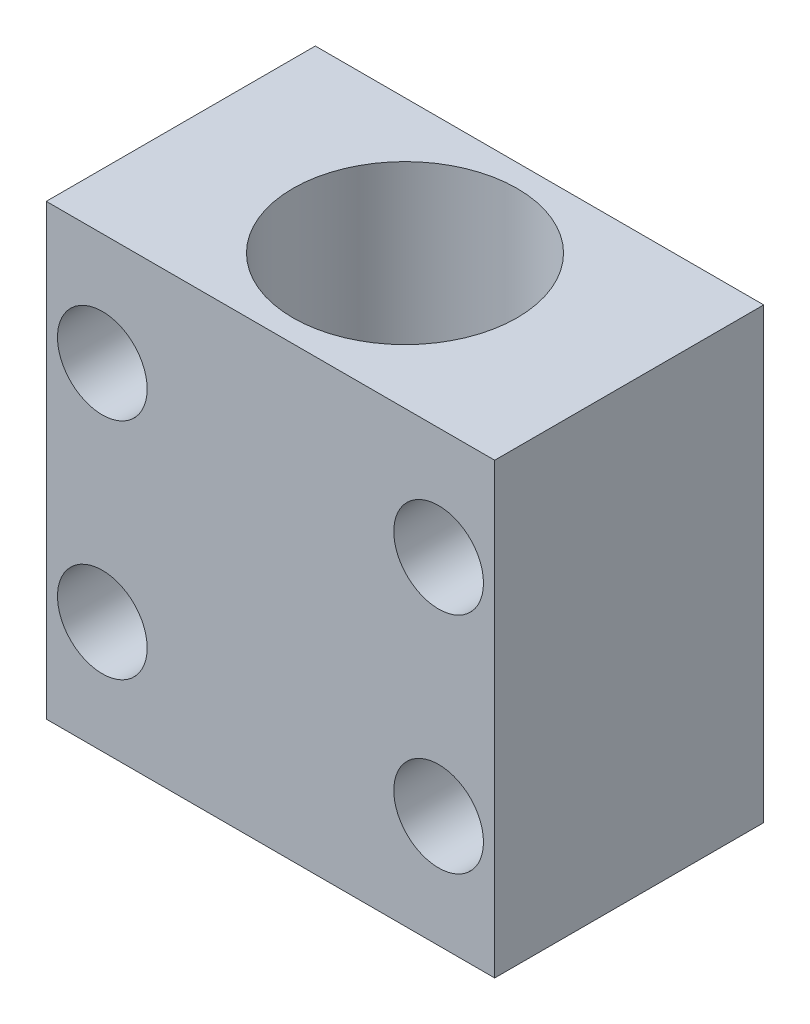
ISO-10303-21;
HEADER;
FILE_DESCRIPTION(('STEP AP214'),'2;1');
FILE_NAME('part.step','',(''),(''),'','','');
FILE_SCHEMA(('AUTOMOTIVE_DESIGN { 1 0 10303 214 1 1 1 1 }'));
ENDSEC;
DATA;
#1=APPLICATION_CONTEXT('core data for automotive mechanical design processes');
#2=APPLICATION_PROTOCOL_DEFINITION('international standard','automotive_design',2000,#1);
#3=PRODUCT_CONTEXT('',#1,'mechanical');
#4=PRODUCT('Part','Part','',(#3));
#5=PRODUCT_RELATED_PRODUCT_CATEGORY('part','',(#4));
#6=PRODUCT_DEFINITION_FORMATION('','',#4);
#7=PRODUCT_DEFINITION_CONTEXT('part definition',#1,'design');
#8=PRODUCT_DEFINITION('design','',#6,#7);
#9=PRODUCT_DEFINITION_SHAPE('','',#8);
#10=(LENGTH_UNIT() NAMED_UNIT(*) SI_UNIT(.MILLI.,.METRE.));
#11=(NAMED_UNIT(*) PLANE_ANGLE_UNIT() SI_UNIT($,.RADIAN.));
#12=(NAMED_UNIT(*) SI_UNIT($,.STERADIAN.) SOLID_ANGLE_UNIT());
#13=UNCERTAINTY_MEASURE_WITH_UNIT(LENGTH_MEASURE(1.E-05),#10,'distance_accuracy_value','');
#14=(GEOMETRIC_REPRESENTATION_CONTEXT(3) GLOBAL_UNCERTAINTY_ASSIGNED_CONTEXT((#13)) GLOBAL_UNIT_ASSIGNED_CONTEXT((#10,
#11,#12)) REPRESENTATION_CONTEXT('',''));
#15=CARTESIAN_POINT('',(0.,0.,0.));
#16=DIRECTION('',(0.,0.,1.));
#17=DIRECTION('',(1.,0.,0.));
#18=AXIS2_PLACEMENT_3D('',#15,#16,#17);
#19=CARTESIAN_POINT('',(0.,127.,0.));
#20=DIRECTION('',(0.,1.,0.));
#21=DIRECTION('',(0.,0.,1.));
#22=AXIS2_PLACEMENT_3D('',#19,#20,#21);
#23=PLANE('',#22);
#24=DIRECTION('',(0.,0.,-1.));
#25=VECTOR('',#24,1.);
#26=CARTESIAN_POINT('',(63.5,127.,-38.1));
#27=LINE('',#26,#25);
#28=CARTESIAN_POINT('',(63.5,127.,38.1));
#29=VERTEX_POINT('',#28);
#30=CARTESIAN_POINT('',(63.5,127.,-38.1));
#31=VERTEX_POINT('',#30);
#32=EDGE_CURVE('E88',#29,#31,#27,.T.);
#33=ORIENTED_EDGE('',*,*,#32,.T.);
#34=DIRECTION('',(-1.,0.,0.));
#35=VECTOR('',#34,1.);
#36=CARTESIAN_POINT('',(-63.5,127.,-38.1));
#37=LINE('',#36,#35);
#38=CARTESIAN_POINT('',(-63.5,127.,-38.1));
#39=VERTEX_POINT('',#38);
#40=EDGE_CURVE('E83',#31,#39,#37,.T.);
#41=ORIENTED_EDGE('',*,*,#40,.T.);
#42=DIRECTION('',(0.,0.,1.));
#43=VECTOR('',#42,1.);
#44=CARTESIAN_POINT('',(-63.5,127.,-38.1));
#45=LINE('',#44,#43);
#46=CARTESIAN_POINT('',(-63.5,127.,38.1));
#47=VERTEX_POINT('',#46);
#48=EDGE_CURVE('E86',#39,#47,#45,.T.);
#49=ORIENTED_EDGE('',*,*,#48,.T.);
#50=DIRECTION('',(1.,0.,0.));
#51=VECTOR('',#50,1.);
#52=CARTESIAN_POINT('',(-63.5,127.,38.1));
#53=LINE('',#52,#51);
#54=EDGE_CURVE('E53',#47,#29,#53,.T.);
#55=ORIENTED_EDGE('',*,*,#54,.T.);
#56=EDGE_LOOP('',(#33,#41,#49,#55));
#57=FACE_BOUND('',#56,.T.);
#58=CARTESIAN_POINT('',(0.,127.,0.));
#59=DIRECTION('',(0.,1.,0.));
#60=DIRECTION('',(0.,0.,1.));
#61=AXIS2_PLACEMENT_3D('',#58,#59,#60);
#62=CIRCLE('',#61,31.75);
#63=CARTESIAN_POINT('',(0.,127.,31.75));
#64=VERTEX_POINT('',#63);
#65=EDGE_CURVE('E103',#64,#64,#62,.T.);
#66=ORIENTED_EDGE('',*,*,#65,.F.);
#67=EDGE_LOOP('',(#66));
#68=FACE_BOUND('',#67,.T.);
#69=ADVANCED_FACE('F36',(#57,#68),#23,.T.);
#70=CARTESIAN_POINT('',(0.,0.,0.));
#71=DIRECTION('',(0.,1.,0.));
#72=DIRECTION('',(0.,0.,1.));
#73=AXIS2_PLACEMENT_3D('',#70,#71,#72);
#74=PLANE('',#73);
#75=DIRECTION('',(0.,0.,-1.));
#76=VECTOR('',#75,1.);
#77=CARTESIAN_POINT('',(63.5,0.,-38.1));
#78=LINE('',#77,#76);
#79=CARTESIAN_POINT('',(63.5,0.,38.1));
#80=VERTEX_POINT('',#79);
#81=CARTESIAN_POINT('',(63.5,0.,-38.1));
#82=VERTEX_POINT('',#81);
#83=EDGE_CURVE('E100',#80,#82,#78,.T.);
#84=ORIENTED_EDGE('',*,*,#83,.F.);
#85=DIRECTION('',(1.,0.,0.));
#86=VECTOR('',#85,1.);
#87=CARTESIAN_POINT('',(-63.5,0.,38.1));
#88=LINE('',#87,#86);
#89=CARTESIAN_POINT('',(-63.5,0.,38.1));
#90=VERTEX_POINT('',#89);
#91=EDGE_CURVE('E76',#90,#80,#88,.T.);
#92=ORIENTED_EDGE('',*,*,#91,.F.);
#93=DIRECTION('',(0.,0.,1.));
#94=VECTOR('',#93,1.);
#95=CARTESIAN_POINT('',(-63.5,0.,-38.1));
#96=LINE('',#95,#94);
#97=CARTESIAN_POINT('',(-63.5,0.,-38.1));
#98=VERTEX_POINT('',#97);
#99=EDGE_CURVE('E70',#98,#90,#96,.T.);
#100=ORIENTED_EDGE('',*,*,#99,.F.);
#101=DIRECTION('',(-1.,0.,0.));
#102=VECTOR('',#101,1.);
#103=CARTESIAN_POINT('',(-63.5,0.,-38.1));
#104=LINE('',#103,#102);
#105=EDGE_CURVE('E92',#82,#98,#104,.T.);
#106=ORIENTED_EDGE('',*,*,#105,.F.);
#107=EDGE_LOOP('',(#84,#92,#100,#106));
#108=FACE_BOUND('',#107,.T.);
#109=CARTESIAN_POINT('',(0.,0.,0.));
#110=DIRECTION('',(0.,1.,0.));
#111=DIRECTION('',(0.,0.,1.));
#112=AXIS2_PLACEMENT_3D('',#109,#110,#111);
#113=CIRCLE('',#112,31.75);
#114=CARTESIAN_POINT('',(0.,0.,31.75));
#115=VERTEX_POINT('',#114);
#116=EDGE_CURVE('E115',#115,#115,#113,.T.);
#117=ORIENTED_EDGE('',*,*,#116,.T.);
#118=EDGE_LOOP('',(#117));
#119=FACE_BOUND('',#118,.T.);
#120=ADVANCED_FACE('F111',(#108,#119),#74,.F.);
#121=CARTESIAN_POINT('',(63.5,127.,-38.1));
#122=DIRECTION('',(-1.,0.,0.));
#123=DIRECTION('',(0.,0.,1.));
#124=AXIS2_PLACEMENT_3D('',#121,#122,#123);
#125=PLANE('',#124);
#126=ORIENTED_EDGE('',*,*,#83,.T.);
#127=DIRECTION('',(0.,-1.,0.));
#128=VECTOR('',#127,1.);
#129=CARTESIAN_POINT('',(63.5,127.,-38.1));
#130=LINE('',#129,#128);
#131=EDGE_CURVE('E11',#31,#82,#130,.T.);
#132=ORIENTED_EDGE('',*,*,#131,.F.);
#133=ORIENTED_EDGE('',*,*,#32,.F.);
#134=DIRECTION('',(0.,-1.,0.));
#135=VECTOR('',#134,1.);
#136=CARTESIAN_POINT('',(63.5,127.,38.1));
#137=LINE('',#136,#135);
#138=EDGE_CURVE('E96',#29,#80,#137,.T.);
#139=ORIENTED_EDGE('',*,*,#138,.T.);
#140=EDGE_LOOP('',(#126,#132,#133,#139));
#141=FACE_BOUND('',#140,.T.);
#142=ADVANCED_FACE('F38',(#141),#125,.F.);
#143=CARTESIAN_POINT('',(-63.5,127.,-38.1));
#144=DIRECTION('',(0.,0.,1.));
#145=DIRECTION('',(1.,0.,0.));
#146=AXIS2_PLACEMENT_3D('',#143,#144,#145);
#147=PLANE('',#146);
#148=CARTESIAN_POINT('',(-47.625,95.25,-38.1));
#149=DIRECTION('',(0.,0.,1.));
#150=DIRECTION('',(1.,0.,0.));
#151=AXIS2_PLACEMENT_3D('',#148,#149,#150);
#152=CIRCLE('',#151,12.7);
#153=CARTESIAN_POINT('',(-34.925,95.25,-38.1));
#154=VERTEX_POINT('',#153);
#155=EDGE_CURVE('E118',#154,#154,#152,.T.);
#156=ORIENTED_EDGE('',*,*,#155,.T.);
#157=EDGE_LOOP('',(#156));
#158=FACE_BOUND('',#157,.T.);
#159=CARTESIAN_POINT('',(-47.625,31.75,-38.1));
#160=DIRECTION('',(0.,0.,1.));
#161=DIRECTION('',(1.,0.,0.));
#162=AXIS2_PLACEMENT_3D('',#159,#160,#161);
#163=CIRCLE('',#162,12.7);
#164=CARTESIAN_POINT('',(-34.925,31.75,-38.1));
#165=VERTEX_POINT('',#164);
#166=EDGE_CURVE('E123',#165,#165,#163,.T.);
#167=ORIENTED_EDGE('',*,*,#166,.T.);
#168=EDGE_LOOP('',(#167));
#169=FACE_BOUND('',#168,.T.);
#170=CARTESIAN_POINT('',(47.625,31.75,-38.1));
#171=DIRECTION('',(0.,0.,1.));
#172=DIRECTION('',(1.,0.,0.));
#173=AXIS2_PLACEMENT_3D('',#170,#171,#172);
#174=CIRCLE('',#173,12.7);
#175=CARTESIAN_POINT('',(60.325,31.75,-38.1));
#176=VERTEX_POINT('',#175);
#177=EDGE_CURVE('E126',#176,#176,#174,.T.);
#178=ORIENTED_EDGE('',*,*,#177,.T.);
#179=EDGE_LOOP('',(#178));
#180=FACE_BOUND('',#179,.T.);
#181=CARTESIAN_POINT('',(47.625,95.25,-38.1));
#182=DIRECTION('',(0.,0.,1.));
#183=DIRECTION('',(1.,0.,0.));
#184=AXIS2_PLACEMENT_3D('',#181,#182,#183);
#185=CIRCLE('',#184,12.7);
#186=CARTESIAN_POINT('',(60.325,95.25,-38.1));
#187=VERTEX_POINT('',#186);
#188=EDGE_CURVE('E129',#187,#187,#185,.T.);
#189=ORIENTED_EDGE('',*,*,#188,.T.);
#190=EDGE_LOOP('',(#189));
#191=FACE_BOUND('',#190,.T.);
#192=ORIENTED_EDGE('',*,*,#105,.T.);
#193=DIRECTION('',(0.,-1.,0.));
#194=VECTOR('',#193,1.);
#195=CARTESIAN_POINT('',(-63.5,127.,-38.1));
#196=LINE('',#195,#194);
#197=EDGE_CURVE('E45',#39,#98,#196,.T.);
#198=ORIENTED_EDGE('',*,*,#197,.F.);
#199=ORIENTED_EDGE('',*,*,#40,.F.);
#200=ORIENTED_EDGE('',*,*,#131,.T.);
#201=EDGE_LOOP('',(#192,#198,#199,#200));
#202=FACE_BOUND('',#201,.T.);
#203=ADVANCED_FACE('F91',(#158,#169,#180,#191,#202),#147,.F.);
#204=CARTESIAN_POINT('',(-63.5,127.,-38.1));
#205=DIRECTION('',(1.,0.,0.));
#206=DIRECTION('',(0.,0.,-1.));
#207=AXIS2_PLACEMENT_3D('',#204,#205,#206);
#208=PLANE('',#207);
#209=ORIENTED_EDGE('',*,*,#99,.T.);
#210=DIRECTION('',(0.,-1.,0.));
#211=VECTOR('',#210,1.);
#212=CARTESIAN_POINT('',(-63.5,127.,38.1));
#213=LINE('',#212,#211);
#214=EDGE_CURVE('E93',#47,#90,#213,.T.);
#215=ORIENTED_EDGE('',*,*,#214,.F.);
#216=ORIENTED_EDGE('',*,*,#48,.F.);
#217=ORIENTED_EDGE('',*,*,#197,.T.);
#218=EDGE_LOOP('',(#209,#215,#216,#217));
#219=FACE_BOUND('',#218,.T.);
#220=ADVANCED_FACE('F94',(#219),#208,.F.);
#221=CARTESIAN_POINT('',(-63.5,127.,38.1));
#222=DIRECTION('',(0.,0.,-1.));
#223=DIRECTION('',(-1.,0.,0.));
#224=AXIS2_PLACEMENT_3D('',#221,#222,#223);
#225=PLANE('',#224);
#226=CARTESIAN_POINT('',(-47.625,95.25,38.1));
#227=DIRECTION('',(0.,0.,1.));
#228=DIRECTION('',(1.,0.,0.));
#229=AXIS2_PLACEMENT_3D('',#226,#227,#228);
#230=CIRCLE('',#229,12.7);
#231=CARTESIAN_POINT('',(-34.925,95.25,38.1));
#232=VERTEX_POINT('',#231);
#233=EDGE_CURVE('E136',#232,#232,#230,.T.);
#234=ORIENTED_EDGE('',*,*,#233,.F.);
#235=EDGE_LOOP('',(#234));
#236=FACE_BOUND('',#235,.T.);
#237=CARTESIAN_POINT('',(-47.625,31.75,38.1));
#238=DIRECTION('',(0.,0.,1.));
#239=DIRECTION('',(1.,0.,0.));
#240=AXIS2_PLACEMENT_3D('',#237,#238,#239);
#241=CIRCLE('',#240,12.7);
#242=CARTESIAN_POINT('',(-34.925,31.75,38.1));
#243=VERTEX_POINT('',#242);
#244=EDGE_CURVE('E139',#243,#243,#241,.T.);
#245=ORIENTED_EDGE('',*,*,#244,.F.);
#246=EDGE_LOOP('',(#245));
#247=FACE_BOUND('',#246,.T.);
#248=CARTESIAN_POINT('',(47.625,31.75,38.1));
#249=DIRECTION('',(0.,0.,1.));
#250=DIRECTION('',(1.,0.,0.));
#251=AXIS2_PLACEMENT_3D('',#248,#249,#250);
#252=CIRCLE('',#251,12.7);
#253=CARTESIAN_POINT('',(60.325,31.75,38.1));
#254=VERTEX_POINT('',#253);
#255=EDGE_CURVE('E135',#254,#254,#252,.T.);
#256=ORIENTED_EDGE('',*,*,#255,.F.);
#257=EDGE_LOOP('',(#256));
#258=FACE_BOUND('',#257,.T.);
#259=CARTESIAN_POINT('',(47.625,95.25,38.1));
#260=DIRECTION('',(0.,0.,1.));
#261=DIRECTION('',(1.,0.,0.));
#262=AXIS2_PLACEMENT_3D('',#259,#260,#261);
#263=CIRCLE('',#262,12.7);
#264=CARTESIAN_POINT('',(60.325,95.25,38.1));
#265=VERTEX_POINT('',#264);
#266=EDGE_CURVE('E132',#265,#265,#263,.T.);
#267=ORIENTED_EDGE('',*,*,#266,.F.);
#268=EDGE_LOOP('',(#267));
#269=FACE_BOUND('',#268,.T.);
#270=ORIENTED_EDGE('',*,*,#91,.T.);
#271=ORIENTED_EDGE('',*,*,#138,.F.);
#272=ORIENTED_EDGE('',*,*,#54,.F.);
#273=ORIENTED_EDGE('',*,*,#214,.T.);
#274=EDGE_LOOP('',(#270,#271,#272,#273));
#275=FACE_BOUND('',#274,.T.);
#276=ADVANCED_FACE('F108',(#236,#247,#258,#269,#275),#225,.F.);
#277=CARTESIAN_POINT('',(0.,127.,0.));
#278=DIRECTION('',(0.,-1.,0.));
#279=DIRECTION('',(0.,0.,-1.));
#280=AXIS2_PLACEMENT_3D('',#277,#278,#279);
#281=CYLINDRICAL_SURFACE('',#280,31.75);
#282=ORIENTED_EDGE('',*,*,#65,.T.);
#283=EDGE_LOOP('',(#282));
#284=FACE_BOUND('',#283,.T.);
#285=ORIENTED_EDGE('',*,*,#116,.F.);
#286=EDGE_LOOP('',(#285));
#287=FACE_BOUND('',#286,.T.);
#288=ADVANCED_FACE('F150',(#284,#287),#281,.F.);
#289=CARTESIAN_POINT('',(47.625,95.25,-88.9));
#290=DIRECTION('',(0.,0.,1.));
#291=DIRECTION('',(1.,0.,0.));
#292=AXIS2_PLACEMENT_3D('',#289,#290,#291);
#293=CYLINDRICAL_SURFACE('',#292,12.7);
#294=ORIENTED_EDGE('',*,*,#266,.T.);
#295=EDGE_LOOP('',(#294));
#296=FACE_BOUND('',#295,.T.);
#297=ORIENTED_EDGE('',*,*,#188,.F.);
#298=EDGE_LOOP('',(#297));
#299=FACE_BOUND('',#298,.T.);
#300=ADVANCED_FACE('F155',(#296,#299),#293,.F.);
#301=CARTESIAN_POINT('',(47.625,31.75,-88.9));
#302=DIRECTION('',(0.,0.,1.));
#303=DIRECTION('',(1.,0.,0.));
#304=AXIS2_PLACEMENT_3D('',#301,#302,#303);
#305=CYLINDRICAL_SURFACE('',#304,12.7);
#306=ORIENTED_EDGE('',*,*,#255,.T.);
#307=EDGE_LOOP('',(#306));
#308=FACE_BOUND('',#307,.T.);
#309=ORIENTED_EDGE('',*,*,#177,.F.);
#310=EDGE_LOOP('',(#309));
#311=FACE_BOUND('',#310,.T.);
#312=ADVANCED_FACE('F145',(#308,#311),#305,.F.);
#313=CARTESIAN_POINT('',(-47.625,31.75,-88.9));
#314=DIRECTION('',(0.,0.,1.));
#315=DIRECTION('',(1.,0.,0.));
#316=AXIS2_PLACEMENT_3D('',#313,#314,#315);
#317=CYLINDRICAL_SURFACE('',#316,12.7);
#318=ORIENTED_EDGE('',*,*,#244,.T.);
#319=EDGE_LOOP('',(#318));
#320=FACE_BOUND('',#319,.T.);
#321=ORIENTED_EDGE('',*,*,#166,.F.);
#322=EDGE_LOOP('',(#321));
#323=FACE_BOUND('',#322,.T.);
#324=ADVANCED_FACE('F182',(#320,#323),#317,.F.);
#325=CARTESIAN_POINT('',(-47.625,95.25,-88.9));
#326=DIRECTION('',(0.,0.,1.));
#327=DIRECTION('',(1.,0.,0.));
#328=AXIS2_PLACEMENT_3D('',#325,#326,#327);
#329=CYLINDRICAL_SURFACE('',#328,12.7);
#330=ORIENTED_EDGE('',*,*,#233,.T.);
#331=EDGE_LOOP('',(#330));
#332=FACE_BOUND('',#331,.T.);
#333=ORIENTED_EDGE('',*,*,#155,.F.);
#334=EDGE_LOOP('',(#333));
#335=FACE_BOUND('',#334,.T.);
#336=ADVANCED_FACE('F179',(#332,#335),#329,.F.);
#337=CLOSED_SHELL('',(#69,#120,#142,#203,#220,#276,#288,#300,#312,#324,#336));
#338=MANIFOLD_SOLID_BREP('B2',#337);
#339=ADVANCED_BREP_SHAPE_REPRESENTATION('',(#18,#338),#14);
#340=SHAPE_DEFINITION_REPRESENTATION(#9,#339);
ENDSEC;
END-ISO-10303-21;
